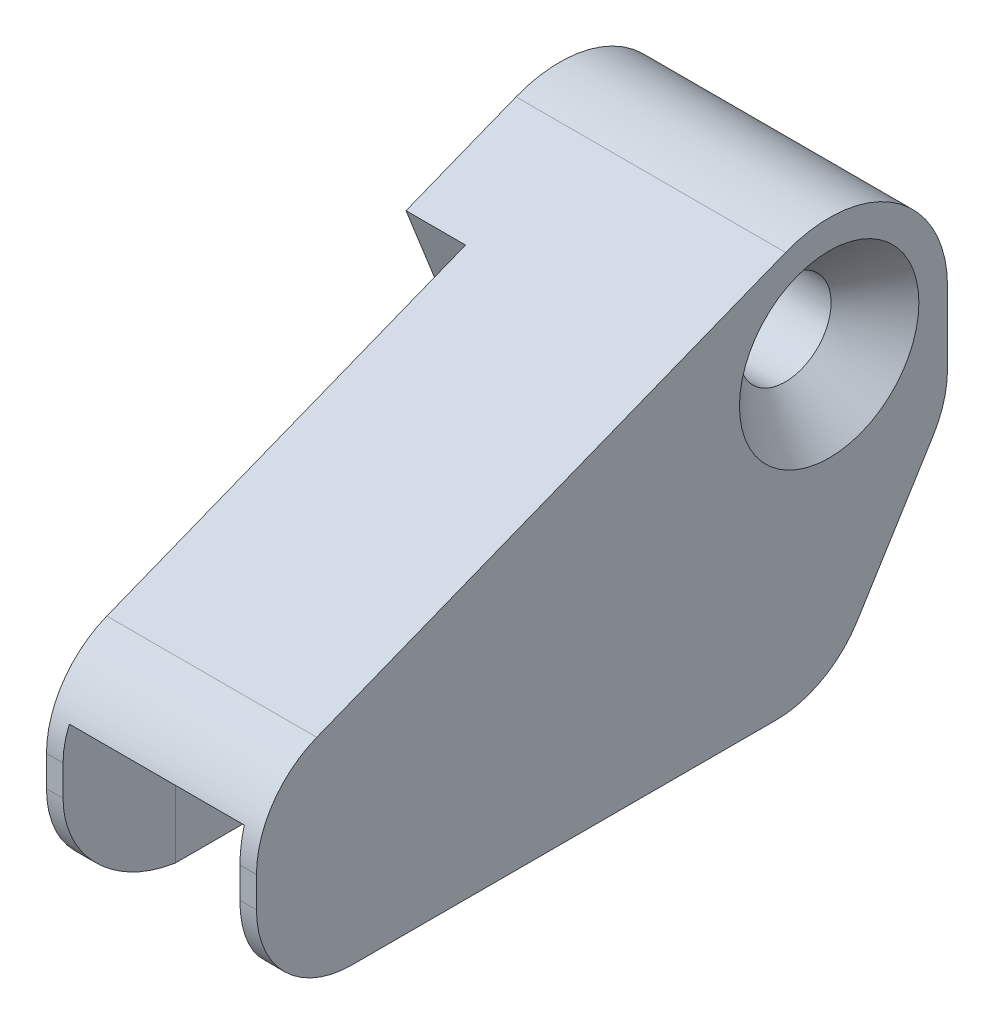
ISO-10303-21;
HEADER;
FILE_DESCRIPTION(('STEP AP214'),'2;1');
FILE_NAME('part.step','',(''),(''),'','','');
FILE_SCHEMA(('AUTOMOTIVE_DESIGN { 1 0 10303 214 1 1 1 1 }'));
ENDSEC;
DATA;
#1=APPLICATION_CONTEXT('core data for automotive mechanical design processes');
#2=APPLICATION_PROTOCOL_DEFINITION('international standard','automotive_design',2000,#1);
#3=PRODUCT_CONTEXT('',#1,'mechanical');
#4=PRODUCT('Part','Part','',(#3));
#5=PRODUCT_RELATED_PRODUCT_CATEGORY('part','',(#4));
#6=PRODUCT_DEFINITION_FORMATION('','',#4);
#7=PRODUCT_DEFINITION_CONTEXT('part definition',#1,'design');
#8=PRODUCT_DEFINITION('design','',#6,#7);
#9=PRODUCT_DEFINITION_SHAPE('','',#8);
#10=(LENGTH_UNIT() NAMED_UNIT(*) SI_UNIT(.MILLI.,.METRE.));
#11=(NAMED_UNIT(*) PLANE_ANGLE_UNIT() SI_UNIT($,.RADIAN.));
#12=(NAMED_UNIT(*) SI_UNIT($,.STERADIAN.) SOLID_ANGLE_UNIT());
#13=UNCERTAINTY_MEASURE_WITH_UNIT(LENGTH_MEASURE(1.E-05),#10,'distance_accuracy_value','');
#14=(GEOMETRIC_REPRESENTATION_CONTEXT(3) GLOBAL_UNCERTAINTY_ASSIGNED_CONTEXT((#13)) GLOBAL_UNIT_ASSIGNED_CONTEXT((#10,
#11,#12)) REPRESENTATION_CONTEXT('',''));
#15=CARTESIAN_POINT('',(0.,0.,0.));
#16=DIRECTION('',(0.,0.,1.));
#17=DIRECTION('',(1.,0.,0.));
#18=AXIS2_PLACEMENT_3D('',#15,#16,#17);
#19=CARTESIAN_POINT('',(11.,-5.2,-6.2));
#20=DIRECTION('',(0.,0.526939668861675,0.84990269171238));
#21=DIRECTION('',(0.,-0.84990269171238,0.526939668861675));
#22=AXIS2_PLACEMENT_3D('',#19,#20,#21);
#23=PLANE('',#22);
#24=DIRECTION('',(0.,-0.84990269171238,0.526939668861675));
#25=VECTOR('',#24,1.);
#26=CARTESIAN_POINT('',(9.25,-8.62041058295059,-4.07934543857064));
#27=LINE('',#26,#25);
#28=CARTESIAN_POINT('',(9.25,-6.41046216360984,-5.4495134585619));
#29=VERTEX_POINT('',#28);
#30=CARTESIAN_POINT('',(9.25,-12.8346983443084,-1.46648702652881));
#31=VERTEX_POINT('',#30);
#32=EDGE_CURVE('E75',#29,#31,#27,.T.);
#33=ORIENTED_EDGE('',*,*,#32,.F.);
#34=DIRECTION('',(-1.,0.,0.));
#35=VECTOR('',#34,1.);
#36=CARTESIAN_POINT('',(11.,-6.41046216360984,-5.4495134585619));
#37=LINE('',#36,#35);
#38=CARTESIAN_POINT('',(11.,-6.41046216360984,-5.4495134585619));
#39=VERTEX_POINT('',#38);
#40=EDGE_CURVE('E395',#29,#39,#37,.F.);
#41=ORIENTED_EDGE('',*,*,#40,.T.);
#42=DIRECTION('',(0.,0.849902691712379,-0.526939668861675));
#43=VECTOR('',#42,1.);
#44=CARTESIAN_POINT('',(11.,-5.2,-6.2));
#45=LINE('',#44,#43);
#46=CARTESIAN_POINT('',(11.,-12.8346983443084,-1.46648702652881));
#47=VERTEX_POINT('',#46);
#48=EDGE_CURVE('E291',#47,#39,#45,.T.);
#49=ORIENTED_EDGE('',*,*,#48,.F.);
#50=DIRECTION('',(-1.,0.,0.));
#51=VECTOR('',#50,1.);
#52=CARTESIAN_POINT('',(11.,-12.8346983443084,-1.46648702652881));
#53=LINE('',#52,#51);
#54=EDGE_CURVE('E389',#47,#31,#53,.T.);
#55=ORIENTED_EDGE('',*,*,#54,.T.);
#56=EDGE_LOOP('',(#33,#41,#49,#55));
#57=FACE_BOUND('',#56,.T.);
#58=ADVANCED_FACE('F44',(#57),#23,.F.);
#59=CARTESIAN_POINT('',(11.,-15.2,30.));
#60=DIRECTION('',(0.,0.,-1.));
#61=DIRECTION('',(0.,1.,0.));
#62=AXIS2_PLACEMENT_3D('',#59,#60,#61);
#63=PLANE('',#62);
#64=DIRECTION('',(0.,-1.,0.));
#65=VECTOR('',#64,1.);
#66=CARTESIAN_POINT('',(11.,-15.2,30.));
#67=LINE('',#66,#65);
#68=CARTESIAN_POINT('',(11.,-8.59908763706365,30.));
#69=VERTEX_POINT('',#68);
#70=CARTESIAN_POINT('',(11.,-10.2,30.));
#71=VERTEX_POINT('',#70);
#72=EDGE_CURVE('E229',#69,#71,#67,.T.);
#73=ORIENTED_EDGE('',*,*,#72,.F.);
#74=DIRECTION('',(-1.,0.,0.));
#75=VECTOR('',#74,1.);
#76=CARTESIAN_POINT('',(11.,-8.59908763706365,30.));
#77=LINE('',#76,#75);
#78=CARTESIAN_POINT('',(10.1316349035423,-8.59908763706365,30.));
#79=VERTEX_POINT('',#78);
#80=EDGE_CURVE('E349',#69,#79,#77,.T.);
#81=ORIENTED_EDGE('',*,*,#80,.T.);
#82=DIRECTION('',(0.,-1.,0.));
#83=VECTOR('',#82,1.);
#84=CARTESIAN_POINT('',(10.1316349035423,-15.2,30.));
#85=LINE('',#84,#83);
#86=CARTESIAN_POINT('',(10.1316349035423,-10.2,30.));
#87=VERTEX_POINT('',#86);
#88=EDGE_CURVE('E330',#79,#87,#85,.T.);
#89=ORIENTED_EDGE('',*,*,#88,.T.);
#90=DIRECTION('',(-1.,0.,0.));
#91=VECTOR('',#90,1.);
#92=CARTESIAN_POINT('',(11.,-10.2,30.));
#93=LINE('',#92,#91);
#94=EDGE_CURVE('E342',#87,#71,#93,.F.);
#95=ORIENTED_EDGE('',*,*,#94,.T.);
#96=EDGE_LOOP('',(#73,#81,#89,#95));
#97=FACE_BOUND('',#96,.T.);
#98=ADVANCED_FACE('F470',(#97),#63,.F.);
#99=CARTESIAN_POINT('',(11.,-15.2,0.));
#100=DIRECTION('',(0.,1.,0.));
#101=DIRECTION('',(0.,0.,1.));
#102=AXIS2_PLACEMENT_3D('',#99,#100,#101);
#103=PLANE('',#102);
#104=DIRECTION('',(0.,0.,-1.));
#105=VECTOR('',#104,1.);
#106=CARTESIAN_POINT('',(0.,-15.2,0.));
#107=LINE('',#106,#105);
#108=CARTESIAN_POINT('',(0.,-15.2,25.));
#109=VERTEX_POINT('',#108);
#110=CARTESIAN_POINT('',(0.,-15.2,2.78302643203309));
#111=VERTEX_POINT('',#110);
#112=EDGE_CURVE('E275',#109,#111,#107,.T.);
#113=ORIENTED_EDGE('',*,*,#112,.T.);
#114=DIRECTION('',(-1.,0.,0.));
#115=VECTOR('',#114,1.);
#116=CARTESIAN_POINT('',(11.,-15.2,2.78302643203309));
#117=LINE('',#116,#115);
#118=CARTESIAN_POINT('',(1.75,-15.2,2.78302643203309));
#119=VERTEX_POINT('',#118);
#120=EDGE_CURVE('E403',#111,#119,#117,.F.);
#121=ORIENTED_EDGE('',*,*,#120,.T.);
#122=DIRECTION('',(0.,0.,1.));
#123=VECTOR('',#122,1.);
#124=CARTESIAN_POINT('',(1.75,-15.2,-14.6915864338116));
#125=LINE('',#124,#123);
#126=CARTESIAN_POINT('',(1.75,-15.2,24.9999999999999));
#127=VERTEX_POINT('',#126);
#128=EDGE_CURVE('E268',#119,#127,#125,.T.);
#129=ORIENTED_EDGE('',*,*,#128,.T.);
#130=DIRECTION('',(-1.,0.,0.));
#131=VECTOR('',#130,1.);
#132=CARTESIAN_POINT('',(11.,-15.2,25.));
#133=LINE('',#132,#131);
#134=EDGE_CURVE('E400',#127,#109,#133,.T.);
#135=ORIENTED_EDGE('',*,*,#134,.T.);
#136=EDGE_LOOP('',(#113,#121,#129,#135));
#137=FACE_BOUND('',#136,.T.);
#138=ADVANCED_FACE('F476',(#137),#103,.F.);
#139=CARTESIAN_POINT('',(11.,0.,0.));
#140=DIRECTION('',(1.,0.,0.));
#141=DIRECTION('',(0.,0.,-1.));
#142=AXIS2_PLACEMENT_3D('',#139,#140,#141);
#143=PLANE('',#142);
#144=CARTESIAN_POINT('',(11.,0.,0.));
#145=DIRECTION('',(1.,0.,0.));
#146=DIRECTION('',(0.,0.,-1.));
#147=AXIS2_PLACEMENT_3D('',#144,#145,#146);
#148=CIRCLE('',#147,4.7);
#149=CARTESIAN_POINT('',(11.,0.,-4.7));
#150=VERTEX_POINT('',#149);
#151=EDGE_CURVE('E260',#150,#150,#148,.T.);
#152=ORIENTED_EDGE('',*,*,#151,.F.);
#153=EDGE_LOOP('',(#152));
#154=FACE_BOUND('',#153,.T.);
#155=DIRECTION('',(0.,-0.367846965999496,0.929886342304782));
#156=VECTOR('',#155,1.);
#157=CARTESIAN_POINT('',(11.,-5.2,30.));
#158=LINE('',#157,#156);
#159=CARTESIAN_POINT('',(11.,5.76529532228965,2.28065118919687));
#160=VERTEX_POINT('',#159);
#161=CARTESIAN_POINT('',(11.,-3.94965592553974,26.8392348299975));
#162=VERTEX_POINT('',#161);
#163=EDGE_CURVE('E224',#160,#162,#158,.T.);
#164=ORIENTED_EDGE('',*,*,#163,.T.);
#165=CARTESIAN_POINT('',(11.,-8.59908763706365,25.));
#166=DIRECTION('',(1.,0.,0.));
#167=DIRECTION('',(0.,0.,-1.));
#168=AXIS2_PLACEMENT_3D('',#165,#166,#167);
#169=CIRCLE('',#168,5.);
#170=EDGE_CURVE('E383',#162,#69,#169,.T.);
#171=ORIENTED_EDGE('',*,*,#170,.T.);
#172=ORIENTED_EDGE('',*,*,#72,.T.);
#173=CARTESIAN_POINT('',(11.,-10.2,25.));
#174=DIRECTION('',(1.,0.,0.));
#175=DIRECTION('',(0.,0.,-1.));
#176=AXIS2_PLACEMENT_3D('',#173,#174,#175);
#177=CIRCLE('',#176,5.);
#178=CARTESIAN_POINT('',(11.,-15.2,25.));
#179=VERTEX_POINT('',#178);
#180=EDGE_CURVE('E376',#71,#179,#177,.T.);
#181=ORIENTED_EDGE('',*,*,#180,.T.);
#182=DIRECTION('',(0.,0.,-1.));
#183=VECTOR('',#182,1.);
#184=CARTESIAN_POINT('',(11.,-15.2,0.));
#185=LINE('',#184,#183);
#186=CARTESIAN_POINT('',(11.,-15.2,2.78302643203309));
#187=VERTEX_POINT('',#186);
#188=EDGE_CURVE('E287',#179,#187,#185,.T.);
#189=ORIENTED_EDGE('',*,*,#188,.T.);
#190=CARTESIAN_POINT('',(11.,-10.2,2.78302643203309));
#191=DIRECTION('',(1.,0.,0.));
#192=DIRECTION('',(0.,0.,-1.));
#193=AXIS2_PLACEMENT_3D('',#190,#191,#192);
#194=CIRCLE('',#193,5.);
#195=EDGE_CURVE('E378',#187,#47,#194,.T.);
#196=ORIENTED_EDGE('',*,*,#195,.T.);
#197=ORIENTED_EDGE('',*,*,#48,.T.);
#198=CARTESIAN_POINT('',(11.,-3.77576381930147,-1.2));
#199=DIRECTION('',(1.,0.,0.));
#200=DIRECTION('',(0.,0.,-1.));
#201=AXIS2_PLACEMENT_3D('',#198,#199,#200);
#202=CIRCLE('',#201,5.);
#203=CARTESIAN_POINT('',(11.,-3.77576381930147,-6.2));
#204=VERTEX_POINT('',#203);
#205=EDGE_CURVE('E380',#39,#204,#202,.T.);
#206=ORIENTED_EDGE('',*,*,#205,.T.);
#207=DIRECTION('',(0.,1.,0.));
#208=VECTOR('',#207,1.);
#209=CARTESIAN_POINT('',(11.,0.,-6.2));
#210=LINE('',#209,#208);
#211=CARTESIAN_POINT('',(11.,0.,-6.2));
#212=VERTEX_POINT('',#211);
#213=EDGE_CURVE('E296',#204,#212,#210,.T.);
#214=ORIENTED_EDGE('',*,*,#213,.T.);
#215=CARTESIAN_POINT('',(11.,0.,0.));
#216=DIRECTION('',(1.,0.,0.));
#217=DIRECTION('',(0.,0.,-1.));
#218=AXIS2_PLACEMENT_3D('',#215,#216,#217);
#219=CIRCLE('',#218,6.2);
#220=EDGE_CURVE('E299',#212,#160,#219,.T.);
#221=ORIENTED_EDGE('',*,*,#220,.T.);
#222=EDGE_LOOP('',(#164,#171,#172,#181,#189,#196,#197,#206,#214,#221));
#223=FACE_BOUND('',#222,.T.);
#224=ADVANCED_FACE('F467',(#154,#223),#143,.T.);
#225=CARTESIAN_POINT('',(0.,0.,0.));
#226=DIRECTION('',(1.,0.,0.));
#227=DIRECTION('',(0.,0.,-1.));
#228=AXIS2_PLACEMENT_3D('',#225,#226,#227);
#229=PLANE('',#228);
#230=DIRECTION('',(0.,0.929886342304782,0.367846965999496));
#231=VECTOR('',#230,1.);
#232=CARTESIAN_POINT('',(0.,3.48464413309277,8.04594651148652));
#233=LINE('',#232,#231);
#234=CARTESIAN_POINT('',(0.,-2.28065118919687,5.76529532228965));
#235=VERTEX_POINT('',#234);
#236=CARTESIAN_POINT('',(0.,3.48464413309278,8.04594651148652));
#237=VERTEX_POINT('',#236);
#238=EDGE_CURVE('E246',#235,#237,#233,.T.);
#239=ORIENTED_EDGE('',*,*,#238,.F.);
#240=CARTESIAN_POINT('',(0.,0.,0.));
#241=DIRECTION('',(-1.,0.,0.));
#242=DIRECTION('',(0.,0.,1.));
#243=AXIS2_PLACEMENT_3D('',#240,#241,#242);
#244=CIRCLE('',#243,6.2);
#245=CARTESIAN_POINT('',(0.,0.,-6.2));
#246=VERTEX_POINT('',#245);
#247=EDGE_CURVE('E11',#246,#235,#244,.T.);
#248=ORIENTED_EDGE('',*,*,#247,.F.);
#249=DIRECTION('',(0.,1.,0.));
#250=VECTOR('',#249,1.);
#251=CARTESIAN_POINT('',(0.,0.,-6.2));
#252=LINE('',#251,#250);
#253=CARTESIAN_POINT('',(0.,-3.77576381930147,-6.2));
#254=VERTEX_POINT('',#253);
#255=EDGE_CURVE('E313',#254,#246,#252,.T.);
#256=ORIENTED_EDGE('',*,*,#255,.F.);
#257=CARTESIAN_POINT('',(0.,-3.77576381930147,-1.2));
#258=DIRECTION('',(1.,0.,0.));
#259=DIRECTION('',(0.,0.,-1.));
#260=AXIS2_PLACEMENT_3D('',#257,#258,#259);
#261=CIRCLE('',#260,5.);
#262=CARTESIAN_POINT('',(0.,-6.41046216360984,-5.4495134585619));
#263=VERTEX_POINT('',#262);
#264=EDGE_CURVE('E369',#254,#263,#261,.F.);
#265=ORIENTED_EDGE('',*,*,#264,.T.);
#266=DIRECTION('',(0.,0.849902691712379,-0.526939668861675));
#267=VECTOR('',#266,1.);
#268=CARTESIAN_POINT('',(0.,-5.2,-6.2));
#269=LINE('',#268,#267);
#270=CARTESIAN_POINT('',(0.,-12.8346983443084,-1.46648702652881));
#271=VERTEX_POINT('',#270);
#272=EDGE_CURVE('E309',#271,#263,#269,.T.);
#273=ORIENTED_EDGE('',*,*,#272,.F.);
#274=CARTESIAN_POINT('',(0.,-10.2,2.78302643203309));
#275=DIRECTION('',(1.,0.,0.));
#276=DIRECTION('',(0.,0.,-1.));
#277=AXIS2_PLACEMENT_3D('',#274,#275,#276);
#278=CIRCLE('',#277,5.);
#279=EDGE_CURVE('E366',#271,#111,#278,.F.);
#280=ORIENTED_EDGE('',*,*,#279,.T.);
#281=ORIENTED_EDGE('',*,*,#112,.F.);
#282=CARTESIAN_POINT('',(0.,-10.2,25.));
#283=DIRECTION('',(1.,0.,0.));
#284=DIRECTION('',(0.,0.,-1.));
#285=AXIS2_PLACEMENT_3D('',#282,#283,#284);
#286=CIRCLE('',#285,5.);
#287=CARTESIAN_POINT('',(0.,-10.2,30.));
#288=VERTEX_POINT('',#287);
#289=EDGE_CURVE('E363',#109,#288,#286,.F.);
#290=ORIENTED_EDGE('',*,*,#289,.T.);
#291=DIRECTION('',(0.,-1.,0.));
#292=VECTOR('',#291,1.);
#293=CARTESIAN_POINT('',(0.,-15.2,30.));
#294=LINE('',#293,#292);
#295=CARTESIAN_POINT('',(0.,-8.59908763706365,30.));
#296=VERTEX_POINT('',#295);
#297=EDGE_CURVE('E292',#296,#288,#294,.T.);
#298=ORIENTED_EDGE('',*,*,#297,.F.);
#299=CARTESIAN_POINT('',(0.,-8.59908763706365,25.));
#300=DIRECTION('',(1.,0.,0.));
#301=DIRECTION('',(0.,0.,-1.));
#302=AXIS2_PLACEMENT_3D('',#299,#300,#301);
#303=CIRCLE('',#302,5.);
#304=CARTESIAN_POINT('',(0.,-3.94965592553974,26.8392348299975));
#305=VERTEX_POINT('',#304);
#306=EDGE_CURVE('E372',#296,#305,#303,.F.);
#307=ORIENTED_EDGE('',*,*,#306,.T.);
#308=DIRECTION('',(0.,-0.367846965999496,0.929886342304782));
#309=VECTOR('',#308,1.);
#310=CARTESIAN_POINT('',(0.,-5.2,30.));
#311=LINE('',#310,#309);
#312=EDGE_CURVE('E64',#237,#305,#311,.T.);
#313=ORIENTED_EDGE('',*,*,#312,.F.);
#314=EDGE_LOOP('',(#239,#248,#256,#265,#273,#280,#281,#290,#298,#307,#313));
#315=FACE_BOUND('',#314,.T.);
#316=ADVANCED_FACE('F490',(#315),#229,.F.);
#317=DIRECTION('',(0.,0.,1.));
#318=VECTOR('',#317,1.);
#319=CARTESIAN_POINT('',(9.25,-15.2,-14.6915864338116));
#320=LINE('',#319,#318);
#321=CARTESIAN_POINT('',(9.25,-15.2,2.78302643203309));
#322=VERTEX_POINT('',#321);
#323=CARTESIAN_POINT('',(9.25,-15.2,24.9999999999999));
#324=VERTEX_POINT('',#323);
#325=EDGE_CURVE('E281',#322,#324,#320,.T.);
#326=ORIENTED_EDGE('',*,*,#325,.F.);
#327=DIRECTION('',(-1.,0.,0.));
#328=VECTOR('',#327,1.);
#329=CARTESIAN_POINT('',(11.,-15.2,2.78302643203309));
#330=LINE('',#329,#328);
#331=EDGE_CURVE('E414',#322,#187,#330,.F.);
#332=ORIENTED_EDGE('',*,*,#331,.T.);
#333=ORIENTED_EDGE('',*,*,#188,.F.);
#334=DIRECTION('',(-1.,0.,0.));
#335=VECTOR('',#334,1.);
#336=CARTESIAN_POINT('',(11.,-15.2,25.));
#337=LINE('',#336,#335);
#338=EDGE_CURVE('E411',#179,#324,#337,.T.);
#339=ORIENTED_EDGE('',*,*,#338,.T.);
#340=EDGE_LOOP('',(#326,#332,#333,#339));
#341=FACE_BOUND('',#340,.T.);
#342=ADVANCED_FACE('F460',(#341),#103,.F.);
#343=CARTESIAN_POINT('',(1.75,-6.41046216360984,-5.4495134585619));
#344=VERTEX_POINT('',#343);
#345=EDGE_CURVE('E396',#263,#344,#37,.F.);
#346=ORIENTED_EDGE('',*,*,#345,.T.);
#347=DIRECTION('',(0.,0.84990269171238,-0.526939668861675));
#348=VECTOR('',#347,1.);
#349=CARTESIAN_POINT('',(1.75,-8.62041058295059,-4.07934543857064));
#350=LINE('',#349,#348);
#351=CARTESIAN_POINT('',(1.75,-12.8346983443084,-1.46648702652881));
#352=VERTEX_POINT('',#351);
#353=EDGE_CURVE('E271',#352,#344,#350,.T.);
#354=ORIENTED_EDGE('',*,*,#353,.F.);
#355=DIRECTION('',(-1.,0.,0.));
#356=VECTOR('',#355,1.);
#357=CARTESIAN_POINT('',(11.,-12.8346983443084,-1.46648702652881));
#358=LINE('',#357,#356);
#359=EDGE_CURVE('E391',#352,#271,#358,.T.);
#360=ORIENTED_EDGE('',*,*,#359,.T.);
#361=ORIENTED_EDGE('',*,*,#272,.T.);
#362=EDGE_LOOP('',(#346,#354,#360,#361));
#363=FACE_BOUND('',#362,.T.);
#364=ADVANCED_FACE('F472',(#363),#23,.F.);
#365=CARTESIAN_POINT('',(11.,0.,-6.2));
#366=DIRECTION('',(0.,0.,1.));
#367=DIRECTION('',(0.,-1.,0.));
#368=AXIS2_PLACEMENT_3D('',#365,#366,#367);
#369=PLANE('',#368);
#370=ORIENTED_EDGE('',*,*,#213,.F.);
#371=DIRECTION('',(-1.,0.,0.));
#372=VECTOR('',#371,1.);
#373=CARTESIAN_POINT('',(11.,-3.77576381930147,-6.2));
#374=LINE('',#373,#372);
#375=EDGE_CURVE('E385',#204,#254,#374,.T.);
#376=ORIENTED_EDGE('',*,*,#375,.T.);
#377=ORIENTED_EDGE('',*,*,#255,.T.);
#378=DIRECTION('',(-1.,0.,0.));
#379=VECTOR('',#378,1.);
#380=CARTESIAN_POINT('',(11.,0.,-6.2));
#381=LINE('',#380,#379);
#382=EDGE_CURVE('E228',#212,#246,#381,.T.);
#383=ORIENTED_EDGE('',*,*,#382,.F.);
#384=EDGE_LOOP('',(#370,#376,#377,#383));
#385=FACE_BOUND('',#384,.T.);
#386=ADVANCED_FACE('F483',(#385),#369,.F.);
#387=CARTESIAN_POINT('',(11.,0.,0.));
#388=DIRECTION('',(-1.,0.,0.));
#389=DIRECTION('',(0.,0.,1.));
#390=AXIS2_PLACEMENT_3D('',#387,#388,#389);
#391=CYLINDRICAL_SURFACE('',#390,6.2);
#392=ORIENTED_EDGE('',*,*,#382,.T.);
#393=ORIENTED_EDGE('',*,*,#247,.T.);
#394=DIRECTION('',(1.,0.,0.));
#395=VECTOR('',#394,1.);
#396=CARTESIAN_POINT('',(-3.12,-2.28065118919687,5.76529532228965));
#397=LINE('',#396,#395);
#398=CARTESIAN_POINT('',(-3.12,-2.28065118919687,5.76529532228965));
#399=VERTEX_POINT('',#398);
#400=EDGE_CURVE('E236',#399,#235,#397,.T.);
#401=ORIENTED_EDGE('',*,*,#400,.F.);
#402=CARTESIAN_POINT('',(-3.12,0.,0.));
#403=DIRECTION('',(-1.,0.,0.));
#404=DIRECTION('',(0.,0.,1.));
#405=AXIS2_PLACEMENT_3D('',#402,#403,#404);
#406=CIRCLE('',#405,6.2);
#407=CARTESIAN_POINT('',(-3.12,5.76529532228965,2.28065118919687));
#408=VERTEX_POINT('',#407);
#409=EDGE_CURVE('E232',#408,#399,#406,.T.);
#410=ORIENTED_EDGE('',*,*,#409,.F.);
#411=DIRECTION('',(-1.,0.,0.));
#412=VECTOR('',#411,1.);
#413=CARTESIAN_POINT('',(11.,5.76529532228965,2.28065118919687));
#414=LINE('',#413,#412);
#415=EDGE_CURVE('E217',#160,#408,#414,.T.);
#416=ORIENTED_EDGE('',*,*,#415,.F.);
#417=ORIENTED_EDGE('',*,*,#220,.F.);
#418=EDGE_LOOP('',(#392,#393,#401,#410,#416,#417));
#419=FACE_BOUND('',#418,.T.);
#420=ADVANCED_FACE('F234',(#419),#391,.T.);
#421=CARTESIAN_POINT('',(11.,-5.2,30.));
#422=DIRECTION('',(0.,-0.929886342304782,-0.367846965999496));
#423=DIRECTION('',(0.,0.367846965999496,-0.929886342304782));
#424=AXIS2_PLACEMENT_3D('',#421,#422,#423);
#425=PLANE('',#424);
#426=ORIENTED_EDGE('',*,*,#415,.T.);
#427=DIRECTION('',(0.,0.367846965999496,-0.929886342304782));
#428=VECTOR('',#427,1.);
#429=CARTESIAN_POINT('',(-3.12,3.48464413309277,8.04594651148652));
#430=LINE('',#429,#428);
#431=CARTESIAN_POINT('',(-3.12,3.48464413309277,8.04594651148652));
#432=VERTEX_POINT('',#431);
#433=EDGE_CURVE('E222',#432,#408,#430,.T.);
#434=ORIENTED_EDGE('',*,*,#433,.F.);
#435=DIRECTION('',(1.,0.,0.));
#436=VECTOR('',#435,1.);
#437=CARTESIAN_POINT('',(-3.12,3.48464413309277,8.04594651148652));
#438=LINE('',#437,#436);
#439=EDGE_CURVE('E254',#432,#237,#438,.T.);
#440=ORIENTED_EDGE('',*,*,#439,.T.);
#441=ORIENTED_EDGE('',*,*,#312,.T.);
#442=DIRECTION('',(-1.,0.,0.));
#443=VECTOR('',#442,1.);
#444=CARTESIAN_POINT('',(11.,-3.94965592553974,26.8392348299975));
#445=LINE('',#444,#443);
#446=EDGE_CURVE('E374',#305,#162,#445,.F.);
#447=ORIENTED_EDGE('',*,*,#446,.T.);
#448=ORIENTED_EDGE('',*,*,#163,.F.);
#449=EDGE_LOOP('',(#426,#434,#440,#441,#447,#448));
#450=FACE_BOUND('',#449,.T.);
#451=ADVANCED_FACE('F219',(#450),#425,.F.);
#452=DIRECTION('',(0.,1.,0.));
#453=VECTOR('',#452,1.);
#454=CARTESIAN_POINT('',(0.868365096457673,-15.2,30.));
#455=LINE('',#454,#453);
#456=CARTESIAN_POINT('',(0.868365096457673,-10.2,30.));
#457=VERTEX_POINT('',#456);
#458=CARTESIAN_POINT('',(0.868365096457673,-8.59908763706365,30.));
#459=VERTEX_POINT('',#458);
#460=EDGE_CURVE('E327',#457,#459,#455,.T.);
#461=ORIENTED_EDGE('',*,*,#460,.T.);
#462=DIRECTION('',(-1.,0.,0.));
#463=VECTOR('',#462,1.);
#464=CARTESIAN_POINT('',(11.,-8.59908763706365,30.));
#465=LINE('',#464,#463);
#466=EDGE_CURVE('E347',#459,#296,#465,.T.);
#467=ORIENTED_EDGE('',*,*,#466,.T.);
#468=ORIENTED_EDGE('',*,*,#297,.T.);
#469=DIRECTION('',(-1.,0.,0.));
#470=VECTOR('',#469,1.);
#471=CARTESIAN_POINT('',(11.,-10.2,30.));
#472=LINE('',#471,#470);
#473=EDGE_CURVE('E344',#288,#457,#472,.F.);
#474=ORIENTED_EDGE('',*,*,#473,.T.);
#475=EDGE_LOOP('',(#461,#467,#468,#474));
#476=FACE_BOUND('',#475,.T.);
#477=ADVANCED_FACE('F479',(#476),#63,.F.);
#478=CARTESIAN_POINT('',(1.75,-15.2,-14.6915864338116));
#479=DIRECTION('',(-1.,0.,0.));
#480=DIRECTION('',(0.,0.,1.));
#481=AXIS2_PLACEMENT_3D('',#478,#479,#480);
#482=PLANE('',#481);
#483=ORIENTED_EDGE('',*,*,#128,.F.);
#484=CARTESIAN_POINT('',(1.75,-10.2,2.78302643203309));
#485=DIRECTION('',(-1.,0.,0.));
#486=DIRECTION('',(0.,0.,1.));
#487=AXIS2_PLACEMENT_3D('',#484,#485,#486);
#488=CIRCLE('',#487,5.);
#489=EDGE_CURVE('E406',#119,#352,#488,.F.);
#490=ORIENTED_EDGE('',*,*,#489,.T.);
#491=ORIENTED_EDGE('',*,*,#353,.T.);
#492=CARTESIAN_POINT('',(1.75,-3.77576381930147,-1.2));
#493=DIRECTION('',(-1.,0.,0.));
#494=DIRECTION('',(0.,0.,1.));
#495=AXIS2_PLACEMENT_3D('',#492,#493,#494);
#496=CIRCLE('',#495,5.);
#497=CARTESIAN_POINT('',(1.75,-4.38452496596373,-6.16280262213948));
#498=VERTEX_POINT('',#497);
#499=EDGE_CURVE('E424',#498,#344,#496,.T.);
#500=ORIENTED_EDGE('',*,*,#499,.F.);
#501=DIRECTION('',(0.,0.618423306720149,-0.78584515886103));
#502=VECTOR('',#501,1.);
#503=CARTESIAN_POINT('',(1.75,-4.37601445009356,-6.17361713644271));
#504=LINE('',#503,#502);
#505=CARTESIAN_POINT('',(1.75,-6.95,-2.90279266816703));
#506=VERTEX_POINT('',#505);
#507=EDGE_CURVE('E48',#498,#506,#504,.F.);
#508=ORIENTED_EDGE('',*,*,#507,.T.);
#509=DIRECTION('',(0.,0.,1.));
#510=VECTOR('',#509,1.);
#511=CARTESIAN_POINT('',(1.75,-6.95,-14.6915864338116));
#512=LINE('',#511,#510);
#513=CARTESIAN_POINT('',(1.75,-6.95,24.9999999999999));
#514=VERTEX_POINT('',#513);
#515=EDGE_CURVE('E272',#506,#514,#512,.T.);
#516=ORIENTED_EDGE('',*,*,#515,.T.);
#517=DIRECTION('',(0.,-1.,0.));
#518=VECTOR('',#517,1.);
#519=CARTESIAN_POINT('',(1.75,-15.2,24.9999999999999));
#520=LINE('',#519,#518);
#521=EDGE_CURVE('E333',#514,#127,#520,.T.);
#522=ORIENTED_EDGE('',*,*,#521,.T.);
#523=EDGE_LOOP('',(#483,#490,#491,#500,#508,#516,#522));
#524=FACE_BOUND('',#523,.T.);
#525=ADVANCED_FACE('F440',(#524),#482,.F.);
#526=CARTESIAN_POINT('',(1.75,-6.95,-14.6915864338116));
#527=DIRECTION('',(0.,1.,0.));
#528=DIRECTION('',(0.,0.,1.));
#529=AXIS2_PLACEMENT_3D('',#526,#527,#528);
#530=PLANE('',#529);
#531=ORIENTED_EDGE('',*,*,#515,.F.);
#532=DIRECTION('',(1.,0.,0.));
#533=VECTOR('',#532,1.);
#534=CARTESIAN_POINT('',(1.75,-6.95,-2.90279266816703));
#535=LINE('',#534,#533);
#536=CARTESIAN_POINT('',(9.25,-6.95,-2.90279266816703));
#537=VERTEX_POINT('',#536);
#538=EDGE_CURVE('E416',#506,#537,#535,.T.);
#539=ORIENTED_EDGE('',*,*,#538,.T.);
#540=DIRECTION('',(0.,0.,1.));
#541=VECTOR('',#540,1.);
#542=CARTESIAN_POINT('',(9.25,-6.95,-14.6915864338116));
#543=LINE('',#542,#541);
#544=CARTESIAN_POINT('',(9.25,-6.95,24.9999999999999));
#545=VERTEX_POINT('',#544);
#546=EDGE_CURVE('E278',#537,#545,#543,.T.);
#547=ORIENTED_EDGE('',*,*,#546,.T.);
#548=DIRECTION('',(-0.173648177666927,0.,-0.984807753012209));
#549=VECTOR('',#548,1.);
#550=CARTESIAN_POINT('',(2.2361862874896,-6.95,-14.7773141939465));
#551=LINE('',#550,#549);
#552=CARTESIAN_POINT('',(10.0823027594312,-6.95,29.7202235079797));
#553=VERTEX_POINT('',#552);
#554=EDGE_CURVE('E336',#545,#553,#551,.F.);
#555=ORIENTED_EDGE('',*,*,#554,.T.);
#556=DIRECTION('',(-1.,0.,0.));
#557=VECTOR('',#556,1.);
#558=CARTESIAN_POINT('',(10.0823027594312,-6.95,29.7202235079797));
#559=LINE('',#558,#557);
#560=CARTESIAN_POINT('',(0.91769724056882,-6.95,29.7202235079797));
#561=VERTEX_POINT('',#560);
#562=EDGE_CURVE('E356',#553,#561,#559,.T.);
#563=ORIENTED_EDGE('',*,*,#562,.T.);
#564=DIRECTION('',(-0.173648177666927,0.,0.984807753012209));
#565=VECTOR('',#564,1.);
#566=CARTESIAN_POINT('',(8.53766104045757,-6.95,-13.4947386564753));
#567=LINE('',#566,#565);
#568=EDGE_CURVE('E339',#561,#514,#567,.F.);
#569=ORIENTED_EDGE('',*,*,#568,.T.);
#570=EDGE_LOOP('',(#531,#539,#547,#555,#563,#569));
#571=FACE_BOUND('',#570,.T.);
#572=ADVANCED_FACE('F445',(#571),#530,.F.);
#573=CARTESIAN_POINT('',(9.25,-15.2,-14.6915864338116));
#574=DIRECTION('',(1.,0.,0.));
#575=DIRECTION('',(0.,0.,-1.));
#576=AXIS2_PLACEMENT_3D('',#573,#574,#575);
#577=PLANE('',#576);
#578=ORIENTED_EDGE('',*,*,#32,.T.);
#579=CARTESIAN_POINT('',(9.25,-10.2,2.78302643203309));
#580=DIRECTION('',(1.,0.,0.));
#581=DIRECTION('',(0.,0.,-1.));
#582=AXIS2_PLACEMENT_3D('',#579,#580,#581);
#583=CIRCLE('',#582,5.);
#584=EDGE_CURVE('E409',#31,#322,#583,.F.);
#585=ORIENTED_EDGE('',*,*,#584,.T.);
#586=ORIENTED_EDGE('',*,*,#325,.T.);
#587=DIRECTION('',(0.,1.,0.));
#588=VECTOR('',#587,1.);
#589=CARTESIAN_POINT('',(9.25,-15.2,24.9999999999999));
#590=LINE('',#589,#588);
#591=EDGE_CURVE('E324',#324,#545,#590,.T.);
#592=ORIENTED_EDGE('',*,*,#591,.T.);
#593=ORIENTED_EDGE('',*,*,#546,.F.);
#594=DIRECTION('',(0.,-0.618423306720149,0.78584515886103));
#595=VECTOR('',#594,1.);
#596=CARTESIAN_POINT('',(9.25,-4.37601445009356,-6.17361713644271));
#597=LINE('',#596,#595);
#598=CARTESIAN_POINT('',(9.25,-4.38452496596373,-6.16280262213948));
#599=VERTEX_POINT('',#598);
#600=EDGE_CURVE('E431',#537,#599,#597,.F.);
#601=ORIENTED_EDGE('',*,*,#600,.T.);
#602=CARTESIAN_POINT('',(9.25,-3.77576381930147,-1.2));
#603=DIRECTION('',(1.,0.,0.));
#604=DIRECTION('',(0.,0.,-1.));
#605=AXIS2_PLACEMENT_3D('',#602,#603,#604);
#606=CIRCLE('',#605,5.);
#607=EDGE_CURVE('E428',#29,#599,#606,.T.);
#608=ORIENTED_EDGE('',*,*,#607,.F.);
#609=EDGE_LOOP('',(#578,#585,#586,#592,#593,#601,#608));
#610=FACE_BOUND('',#609,.T.);
#611=ADVANCED_FACE('F453',(#610),#577,.F.);
#612=CARTESIAN_POINT('',(9.25,-15.2,24.9999999999999));
#613=DIRECTION('',(0.984807753012209,0.,-0.173648177666927));
#614=DIRECTION('',(0.,1.,0.));
#615=AXIS2_PLACEMENT_3D('',#612,#613,#614);
#616=PLANE('',#615);
#617=ORIENTED_EDGE('',*,*,#88,.F.);
#618=CARTESIAN_POINT('',(9.25000000000002,-8.59908763706365,25.));
#619=DIRECTION('',(0.984807753012209,0.,-0.173648177666927));
#620=DIRECTION('',(-0.173648177666927,0.,-0.984807753012209));
#621=AXIS2_PLACEMENT_3D('',#618,#619,#620);
#622=ELLIPSE('',#621,5.07713305942872,5.);
#623=EDGE_CURVE('E354',#79,#553,#622,.F.);
#624=ORIENTED_EDGE('',*,*,#623,.T.);
#625=ORIENTED_EDGE('',*,*,#554,.F.);
#626=ORIENTED_EDGE('',*,*,#591,.F.);
#627=CARTESIAN_POINT('',(9.25000000000002,-10.2,25.));
#628=DIRECTION('',(0.984807753012209,0.,-0.173648177666927));
#629=DIRECTION('',(-0.173648177666927,0.,-0.984807753012209));
#630=AXIS2_PLACEMENT_3D('',#627,#628,#629);
#631=ELLIPSE('',#630,5.07713305942872,5.);
#632=EDGE_CURVE('E352',#324,#87,#631,.F.);
#633=ORIENTED_EDGE('',*,*,#632,.T.);
#634=EDGE_LOOP('',(#617,#624,#625,#626,#633));
#635=FACE_BOUND('',#634,.T.);
#636=ADVANCED_FACE('F515',(#635),#616,.F.);
#637=CARTESIAN_POINT('',(1.75,-15.2,24.9999999999999));
#638=DIRECTION('',(-0.984807753012209,0.,-0.173648177666927));
#639=DIRECTION('',(0.,-1.,0.));
#640=AXIS2_PLACEMENT_3D('',#637,#638,#639);
#641=PLANE('',#640);
#642=ORIENTED_EDGE('',*,*,#568,.F.);
#643=CARTESIAN_POINT('',(1.74999999999998,-8.59908763706365,25.));
#644=DIRECTION('',(-0.984807753012209,0.,-0.173648177666927));
#645=DIRECTION('',(-0.173648177666927,0.,0.984807753012209));
#646=AXIS2_PLACEMENT_3D('',#643,#644,#645);
#647=ELLIPSE('',#646,5.07713305942872,5.);
#648=EDGE_CURVE('E361',#561,#459,#647,.F.);
#649=ORIENTED_EDGE('',*,*,#648,.T.);
#650=ORIENTED_EDGE('',*,*,#460,.F.);
#651=CARTESIAN_POINT('',(1.74999999999998,-10.2,25.));
#652=DIRECTION('',(-0.984807753012209,0.,-0.173648177666927));
#653=DIRECTION('',(-0.173648177666927,0.,0.984807753012209));
#654=AXIS2_PLACEMENT_3D('',#651,#652,#653);
#655=ELLIPSE('',#654,5.07713305942872,5.);
#656=EDGE_CURVE('E358',#457,#127,#655,.F.);
#657=ORIENTED_EDGE('',*,*,#656,.T.);
#658=ORIENTED_EDGE('',*,*,#521,.F.);
#659=EDGE_LOOP('',(#642,#649,#650,#657,#658));
#660=FACE_BOUND('',#659,.T.);
#661=ADVANCED_FACE('F521',(#660),#641,.F.);
#662=CARTESIAN_POINT('',(11.,-8.59908763706365,25.));
#663=DIRECTION('',(-1.,0.,0.));
#664=DIRECTION('',(0.,0.,1.));
#665=AXIS2_PLACEMENT_3D('',#662,#663,#664);
#666=CYLINDRICAL_SURFACE('',#665,5.);
#667=ORIENTED_EDGE('',*,*,#170,.F.);
#668=ORIENTED_EDGE('',*,*,#446,.F.);
#669=ORIENTED_EDGE('',*,*,#306,.F.);
#670=ORIENTED_EDGE('',*,*,#466,.F.);
#671=ORIENTED_EDGE('',*,*,#648,.F.);
#672=ORIENTED_EDGE('',*,*,#562,.F.);
#673=ORIENTED_EDGE('',*,*,#623,.F.);
#674=ORIENTED_EDGE('',*,*,#80,.F.);
#675=EDGE_LOOP('',(#667,#668,#669,#670,#671,#672,#673,#674));
#676=FACE_BOUND('',#675,.T.);
#677=ADVANCED_FACE('F506',(#676),#666,.T.);
#678=CARTESIAN_POINT('',(11.,-3.77576381930147,-1.2));
#679=DIRECTION('',(-1.,0.,0.));
#680=DIRECTION('',(0.,0.,1.));
#681=AXIS2_PLACEMENT_3D('',#678,#679,#680);
#682=CYLINDRICAL_SURFACE('',#681,5.);
#683=ORIENTED_EDGE('',*,*,#40,.F.);
#684=ORIENTED_EDGE('',*,*,#607,.T.);
#685=DIRECTION('',(-1.,0.,0.));
#686=VECTOR('',#685,1.);
#687=CARTESIAN_POINT('',(5.5,-4.38452496596373,-6.16280262213948));
#688=LINE('',#687,#686);
#689=EDGE_CURVE('E420',#599,#498,#688,.T.);
#690=ORIENTED_EDGE('',*,*,#689,.T.);
#691=ORIENTED_EDGE('',*,*,#499,.T.);
#692=ORIENTED_EDGE('',*,*,#345,.F.);
#693=ORIENTED_EDGE('',*,*,#264,.F.);
#694=ORIENTED_EDGE('',*,*,#375,.F.);
#695=ORIENTED_EDGE('',*,*,#205,.F.);
#696=EDGE_LOOP('',(#683,#684,#690,#691,#692,#693,#694,#695));
#697=FACE_BOUND('',#696,.T.);
#698=ADVANCED_FACE('F450',(#697),#682,.T.);
#699=CARTESIAN_POINT('',(11.,-10.2,2.78302643203309));
#700=DIRECTION('',(-1.,0.,0.));
#701=DIRECTION('',(0.,0.,1.));
#702=AXIS2_PLACEMENT_3D('',#699,#700,#701);
#703=CYLINDRICAL_SURFACE('',#702,5.);
#704=ORIENTED_EDGE('',*,*,#489,.F.);
#705=ORIENTED_EDGE('',*,*,#120,.F.);
#706=ORIENTED_EDGE('',*,*,#279,.F.);
#707=ORIENTED_EDGE('',*,*,#359,.F.);
#708=EDGE_LOOP('',(#704,#705,#706,#707));
#709=FACE_BOUND('',#708,.T.);
#710=ADVANCED_FACE('F532',(#709),#703,.T.);
#711=CARTESIAN_POINT('',(11.,-10.2,2.78302643203309));
#712=DIRECTION('',(-1.,0.,0.));
#713=DIRECTION('',(0.,0.,1.));
#714=AXIS2_PLACEMENT_3D('',#711,#712,#713);
#715=CYLINDRICAL_SURFACE('',#714,5.);
#716=ORIENTED_EDGE('',*,*,#195,.F.);
#717=ORIENTED_EDGE('',*,*,#331,.F.);
#718=ORIENTED_EDGE('',*,*,#584,.F.);
#719=ORIENTED_EDGE('',*,*,#54,.F.);
#720=EDGE_LOOP('',(#716,#717,#718,#719));
#721=FACE_BOUND('',#720,.T.);
#722=ADVANCED_FACE('F464',(#721),#715,.T.);
#723=CARTESIAN_POINT('',(11.,-10.2,25.));
#724=DIRECTION('',(-1.,0.,0.));
#725=DIRECTION('',(0.,0.,1.));
#726=AXIS2_PLACEMENT_3D('',#723,#724,#725);
#727=CYLINDRICAL_SURFACE('',#726,5.);
#728=ORIENTED_EDGE('',*,*,#656,.F.);
#729=ORIENTED_EDGE('',*,*,#473,.F.);
#730=ORIENTED_EDGE('',*,*,#289,.F.);
#731=ORIENTED_EDGE('',*,*,#134,.F.);
#732=EDGE_LOOP('',(#728,#729,#730,#731));
#733=FACE_BOUND('',#732,.T.);
#734=ADVANCED_FACE('F526',(#733),#727,.T.);
#735=CARTESIAN_POINT('',(11.,-10.2,25.));
#736=DIRECTION('',(-1.,0.,0.));
#737=DIRECTION('',(0.,0.,1.));
#738=AXIS2_PLACEMENT_3D('',#735,#736,#737);
#739=CYLINDRICAL_SURFACE('',#738,5.);
#740=ORIENTED_EDGE('',*,*,#180,.F.);
#741=ORIENTED_EDGE('',*,*,#94,.F.);
#742=ORIENTED_EDGE('',*,*,#632,.F.);
#743=ORIENTED_EDGE('',*,*,#338,.F.);
#744=EDGE_LOOP('',(#740,#741,#742,#743));
#745=FACE_BOUND('',#744,.T.);
#746=ADVANCED_FACE('F513',(#745),#739,.T.);
#747=CARTESIAN_POINT('',(1.75,-6.95,-2.90279266816703));
#748=DIRECTION('',(0.,0.78584515886103,0.618423306720149));
#749=DIRECTION('',(1.,0.,0.));
#750=AXIS2_PLACEMENT_3D('',#747,#748,#749);
#751=PLANE('',#750);
#752=ORIENTED_EDGE('',*,*,#507,.F.);
#753=ORIENTED_EDGE('',*,*,#689,.F.);
#754=ORIENTED_EDGE('',*,*,#600,.F.);
#755=ORIENTED_EDGE('',*,*,#538,.F.);
#756=EDGE_LOOP('',(#752,#753,#754,#755));
#757=FACE_BOUND('',#756,.T.);
#758=ADVANCED_FACE('F46',(#757),#751,.F.);
#759=CARTESIAN_POINT('',(11.,0.,0.));
#760=DIRECTION('',(1.,0.,0.));
#761=DIRECTION('',(0.,0.,-1.));
#762=AXIS2_PLACEMENT_3D('',#759,#760,#761);
#763=CYLINDRICAL_SURFACE('',#762,2.4);
#764=CARTESIAN_POINT('',(8.7,0.,0.));
#765=DIRECTION('',(1.,0.,0.));
#766=DIRECTION('',(0.,0.,-1.));
#767=AXIS2_PLACEMENT_3D('',#764,#765,#766);
#768=CIRCLE('',#767,2.4);
#769=CARTESIAN_POINT('',(8.7,0.,-2.4));
#770=VERTEX_POINT('',#769);
#771=EDGE_CURVE('E264',#770,#770,#768,.T.);
#772=ORIENTED_EDGE('',*,*,#771,.T.);
#773=EDGE_LOOP('',(#772));
#774=FACE_BOUND('',#773,.T.);
#775=CARTESIAN_POINT('',(-3.12,0.,0.));
#776=DIRECTION('',(-1.,0.,0.));
#777=DIRECTION('',(0.,0.,1.));
#778=AXIS2_PLACEMENT_3D('',#775,#776,#777);
#779=CIRCLE('',#778,2.4);
#780=CARTESIAN_POINT('',(-3.12,0.,2.4));
#781=VERTEX_POINT('',#780);
#782=EDGE_CURVE('E250',#781,#781,#779,.T.);
#783=ORIENTED_EDGE('',*,*,#782,.T.);
#784=EDGE_LOOP('',(#783));
#785=FACE_BOUND('',#784,.T.);
#786=ADVANCED_FACE('F558',(#774,#785),#763,.F.);
#787=CARTESIAN_POINT('',(11.,0.,0.));
#788=DIRECTION('',(1.,0.,0.));
#789=DIRECTION('',(0.,0.,-1.));
#790=AXIS2_PLACEMENT_3D('',#787,#788,#789);
#791=CONICAL_SURFACE('',#790,4.7,0.785398163397447);
#792=ORIENTED_EDGE('',*,*,#771,.F.);
#793=EDGE_LOOP('',(#792));
#794=FACE_BOUND('',#793,.T.);
#795=ORIENTED_EDGE('',*,*,#151,.T.);
#796=EDGE_LOOP('',(#795));
#797=FACE_BOUND('',#796,.T.);
#798=ADVANCED_FACE('F562',(#794,#797),#791,.F.);
#799=CARTESIAN_POINT('',(-3.12,0.,0.));
#800=DIRECTION('',(-1.,0.,0.));
#801=DIRECTION('',(0.,0.,1.));
#802=AXIS2_PLACEMENT_3D('',#799,#800,#801);
#803=PLANE('',#802);
#804=ORIENTED_EDGE('',*,*,#433,.T.);
#805=ORIENTED_EDGE('',*,*,#409,.T.);
#806=DIRECTION('',(0.,0.929886342304782,0.367846965999496));
#807=VECTOR('',#806,1.);
#808=CARTESIAN_POINT('',(-3.12,3.48464413309277,8.04594651148652));
#809=LINE('',#808,#807);
#810=EDGE_CURVE('E240',#399,#432,#809,.T.);
#811=ORIENTED_EDGE('',*,*,#810,.T.);
#812=EDGE_LOOP('',(#804,#805,#811));
#813=FACE_BOUND('',#812,.T.);
#814=ORIENTED_EDGE('',*,*,#782,.F.);
#815=EDGE_LOOP('',(#814));
#816=FACE_BOUND('',#815,.T.);
#817=ADVANCED_FACE('F242',(#813,#816),#803,.T.);
#818=CARTESIAN_POINT('',(-3.12,3.48464413309277,8.04594651148652));
#819=DIRECTION('',(0.,0.367846965999496,-0.929886342304782));
#820=DIRECTION('',(0.,0.929886342304782,0.367846965999496));
#821=AXIS2_PLACEMENT_3D('',#818,#819,#820);
#822=PLANE('',#821);
#823=ORIENTED_EDGE('',*,*,#238,.T.);
#824=ORIENTED_EDGE('',*,*,#439,.F.);
#825=ORIENTED_EDGE('',*,*,#810,.F.);
#826=ORIENTED_EDGE('',*,*,#400,.T.);
#827=EDGE_LOOP('',(#823,#824,#825,#826));
#828=FACE_BOUND('',#827,.T.);
#829=ADVANCED_FACE('F499',(#828),#822,.F.);
#830=CLOSED_SHELL('',(#58,#98,#138,#224,#316,#342,#364,#386,#420,#451,#477,#525,#572,#611,#636,
#661,#677,#698,#710,#722,#734,#746,#758,#786,#798,#817,#829));
#831=MANIFOLD_SOLID_BREP('B2',#830);
#832=ADVANCED_BREP_SHAPE_REPRESENTATION('',(#18,#831),#14);
#833=SHAPE_DEFINITION_REPRESENTATION(#9,#832);
ENDSEC;
END-ISO-10303-21;
